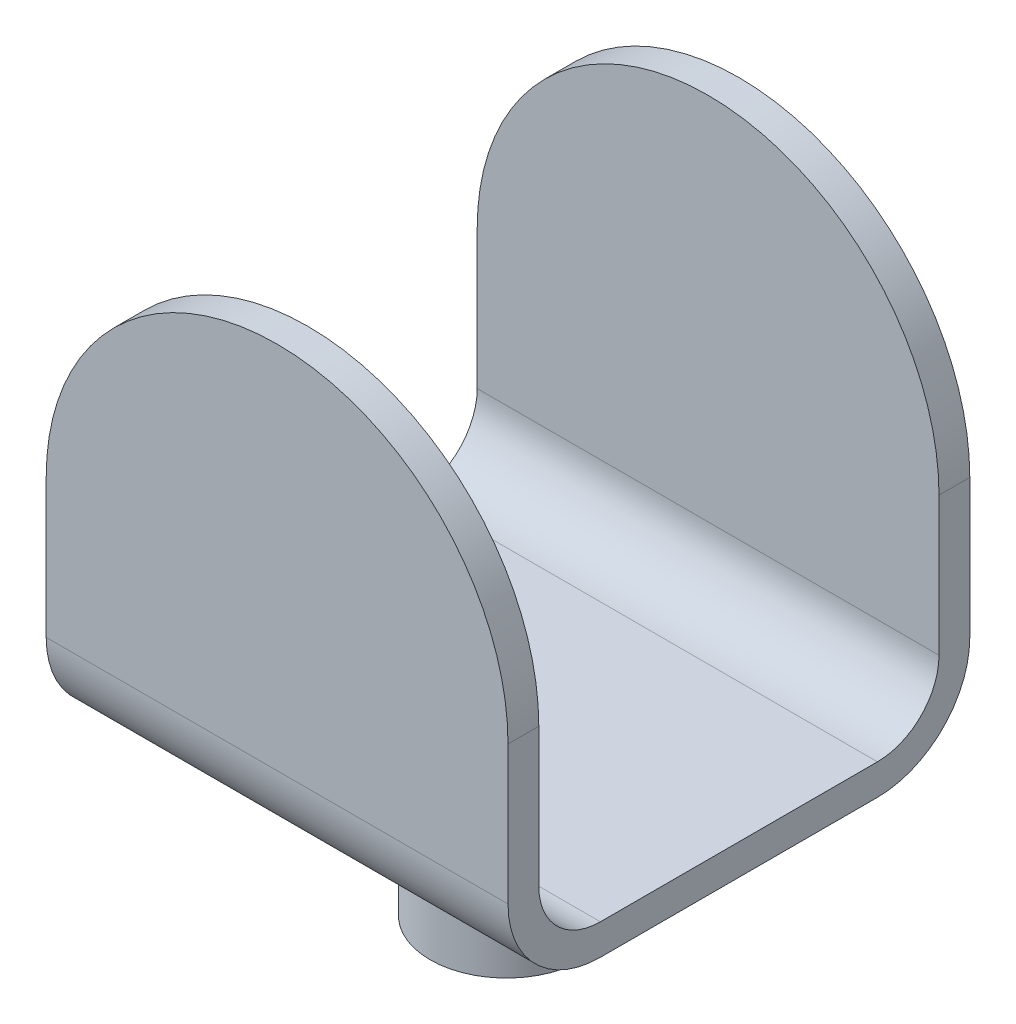
ISO-10303-21;
HEADER;
FILE_DESCRIPTION(('STEP AP214'),'2;1');
FILE_NAME('part.step','',(''),(''),'','','');
FILE_SCHEMA(('AUTOMOTIVE_DESIGN { 1 0 10303 214 1 1 1 1 }'));
ENDSEC;
DATA;
#1=APPLICATION_CONTEXT('core data for automotive mechanical design processes');
#2=APPLICATION_PROTOCOL_DEFINITION('international standard','automotive_design',2000,#1);
#3=PRODUCT_CONTEXT('',#1,'mechanical');
#4=PRODUCT('Part','Part','',(#3));
#5=PRODUCT_RELATED_PRODUCT_CATEGORY('part','',(#4));
#6=PRODUCT_DEFINITION_FORMATION('','',#4);
#7=PRODUCT_DEFINITION_CONTEXT('part definition',#1,'design');
#8=PRODUCT_DEFINITION('design','',#6,#7);
#9=PRODUCT_DEFINITION_SHAPE('','',#8);
#10=(LENGTH_UNIT() NAMED_UNIT(*) SI_UNIT(.MILLI.,.METRE.));
#11=(NAMED_UNIT(*) PLANE_ANGLE_UNIT() SI_UNIT($,.RADIAN.));
#12=(NAMED_UNIT(*) SI_UNIT($,.STERADIAN.) SOLID_ANGLE_UNIT());
#13=UNCERTAINTY_MEASURE_WITH_UNIT(LENGTH_MEASURE(1.E-05),#10,'distance_accuracy_value','');
#14=(GEOMETRIC_REPRESENTATION_CONTEXT(3) GLOBAL_UNCERTAINTY_ASSIGNED_CONTEXT((#13)) GLOBAL_UNIT_ASSIGNED_CONTEXT((#10,
#11,#12)) REPRESENTATION_CONTEXT('',''));
#15=CARTESIAN_POINT('',(0.,0.,0.));
#16=DIRECTION('',(0.,0.,1.));
#17=DIRECTION('',(1.,0.,0.));
#18=AXIS2_PLACEMENT_3D('',#15,#16,#17);
#19=CARTESIAN_POINT('',(38.1034902062651,38.1034902062652,76.2));
#20=DIRECTION('',(0.,0.,-1.));
#21=DIRECTION('',(-1.,0.,0.));
#22=AXIS2_PLACEMENT_3D('',#19,#20,#21);
#23=CYLINDRICAL_SURFACE('',#22,38.1034902062651);
#24=CARTESIAN_POINT('',(38.1034902062651,38.1034902062652,71.12));
#25=DIRECTION('',(0.,0.,1.));
#26=DIRECTION('',(1.,0.,0.));
#27=AXIS2_PLACEMENT_3D('',#24,#25,#26);
#28=CIRCLE('',#27,38.1034902062651);
#29=CARTESIAN_POINT('',(0.,38.1034902062652,71.12));
#30=VERTEX_POINT('',#29);
#31=CARTESIAN_POINT('',(76.2069804125302,38.1034902062652,71.12));
#32=VERTEX_POINT('',#31);
#33=EDGE_CURVE('E191',#30,#32,#28,.F.);
#34=ORIENTED_EDGE('',*,*,#33,.F.);
#35=DIRECTION('',(0.,0.,-1.));
#36=VECTOR('',#35,1.);
#37=CARTESIAN_POINT('',(0.,38.1034902062652,76.2));
#38=LINE('',#37,#36);
#39=CARTESIAN_POINT('',(0.,38.1034902062652,76.2));
#40=VERTEX_POINT('',#39);
#41=EDGE_CURVE('E247',#40,#30,#38,.T.);
#42=ORIENTED_EDGE('',*,*,#41,.F.);
#43=CARTESIAN_POINT('',(38.1034902062651,38.1034902062652,76.2));
#44=DIRECTION('',(0.,0.,-1.));
#45=DIRECTION('',(-1.,0.,0.));
#46=AXIS2_PLACEMENT_3D('',#43,#44,#45);
#47=CIRCLE('',#46,38.1034902062651);
#48=CARTESIAN_POINT('',(76.2069804125302,38.1034902062652,76.2));
#49=VERTEX_POINT('',#48);
#50=EDGE_CURVE('E255',#49,#40,#47,.F.);
#51=ORIENTED_EDGE('',*,*,#50,.F.);
#52=DIRECTION('',(0.,0.,1.));
#53=VECTOR('',#52,1.);
#54=CARTESIAN_POINT('',(76.2069804125302,38.1034902062652,76.2));
#55=LINE('',#54,#53);
#56=EDGE_CURVE('E251',#32,#49,#55,.T.);
#57=ORIENTED_EDGE('',*,*,#56,.F.);
#58=EDGE_LOOP('',(#34,#42,#51,#57));
#59=FACE_BOUND('',#58,.T.);
#60=ADVANCED_FACE('F45',(#59),#23,.T.);
#61=CARTESIAN_POINT('',(38.1034902062651,38.1034902062652,5.08));
#62=DIRECTION('',(0.,0.,-1.));
#63=DIRECTION('',(-1.,0.,0.));
#64=AXIS2_PLACEMENT_3D('',#61,#62,#63);
#65=CIRCLE('',#64,38.1034902062651);
#66=CARTESIAN_POINT('',(76.2069804125302,38.1034902062652,5.08));
#67=VERTEX_POINT('',#66);
#68=CARTESIAN_POINT('',(0.,38.1034902062652,5.08));
#69=VERTEX_POINT('',#68);
#70=EDGE_CURVE('E184',#67,#69,#65,.F.);
#71=ORIENTED_EDGE('',*,*,#70,.F.);
#72=CARTESIAN_POINT('',(76.2069804125302,38.1034902062652,0.));
#73=VERTEX_POINT('',#72);
#74=EDGE_CURVE('E252',#73,#67,#55,.T.);
#75=ORIENTED_EDGE('',*,*,#74,.F.);
#76=CARTESIAN_POINT('',(38.1034902062651,38.1034902062652,0.));
#77=DIRECTION('',(0.,0.,-1.));
#78=DIRECTION('',(-1.,0.,0.));
#79=AXIS2_PLACEMENT_3D('',#76,#77,#78);
#80=CIRCLE('',#79,38.1034902062651);
#81=CARTESIAN_POINT('',(0.,38.1034902062652,0.));
#82=VERTEX_POINT('',#81);
#83=EDGE_CURVE('E70',#82,#73,#80,.T.);
#84=ORIENTED_EDGE('',*,*,#83,.F.);
#85=EDGE_CURVE('E246',#69,#82,#38,.T.);
#86=ORIENTED_EDGE('',*,*,#85,.F.);
#87=EDGE_LOOP('',(#71,#75,#84,#86));
#88=FACE_BOUND('',#87,.T.);
#89=ADVANCED_FACE('F48',(#88),#23,.T.);
#90=CARTESIAN_POINT('',(0.,0.,76.2));
#91=DIRECTION('',(-1.,0.,0.));
#92=DIRECTION('',(0.,0.,1.));
#93=AXIS2_PLACEMENT_3D('',#90,#91,#92);
#94=PLANE('',#93);
#95=DIRECTION('',(0.,1.,0.));
#96=VECTOR('',#95,1.);
#97=CARTESIAN_POINT('',(0.,0.,71.12));
#98=LINE('',#97,#96);
#99=CARTESIAN_POINT('',(0.,15.24,71.12));
#100=VERTEX_POINT('',#99);
#101=EDGE_CURVE('E187',#100,#30,#98,.T.);
#102=ORIENTED_EDGE('',*,*,#101,.F.);
#103=CARTESIAN_POINT('',(0.,15.24,60.96));
#104=DIRECTION('',(-1.,0.,0.));
#105=DIRECTION('',(0.,0.,1.));
#106=AXIS2_PLACEMENT_3D('',#103,#104,#105);
#107=CIRCLE('',#106,10.16);
#108=CARTESIAN_POINT('',(0.,5.08,60.96));
#109=VERTEX_POINT('',#108);
#110=EDGE_CURVE('E194',#109,#100,#107,.T.);
#111=ORIENTED_EDGE('',*,*,#110,.F.);
#112=DIRECTION('',(0.,0.,1.));
#113=VECTOR('',#112,1.);
#114=CARTESIAN_POINT('',(0.,5.08,76.2));
#115=LINE('',#114,#113);
#116=CARTESIAN_POINT('',(0.,5.08,15.24));
#117=VERTEX_POINT('',#116);
#118=EDGE_CURVE('E172',#117,#109,#115,.T.);
#119=ORIENTED_EDGE('',*,*,#118,.F.);
#120=CARTESIAN_POINT('',(0.,15.24,15.24));
#121=DIRECTION('',(-1.,0.,0.));
#122=DIRECTION('',(0.,0.,1.));
#123=AXIS2_PLACEMENT_3D('',#120,#121,#122);
#124=CIRCLE('',#123,10.16);
#125=CARTESIAN_POINT('',(0.,15.24,5.08));
#126=VERTEX_POINT('',#125);
#127=EDGE_CURVE('E147',#126,#117,#124,.T.);
#128=ORIENTED_EDGE('',*,*,#127,.F.);
#129=DIRECTION('',(0.,-1.,0.));
#130=VECTOR('',#129,1.);
#131=CARTESIAN_POINT('',(0.,0.,5.08));
#132=LINE('',#131,#130);
#133=EDGE_CURVE('E181',#69,#126,#132,.T.);
#134=ORIENTED_EDGE('',*,*,#133,.F.);
#135=ORIENTED_EDGE('',*,*,#85,.T.);
#136=DIRECTION('',(0.,1.,0.));
#137=VECTOR('',#136,1.);
#138=CARTESIAN_POINT('',(0.,0.,0.));
#139=LINE('',#138,#137);
#140=CARTESIAN_POINT('',(0.,15.24,0.));
#141=VERTEX_POINT('',#140);
#142=EDGE_CURVE('E197',#141,#82,#139,.T.);
#143=ORIENTED_EDGE('',*,*,#142,.F.);
#144=CARTESIAN_POINT('',(0.,15.24,15.24));
#145=DIRECTION('',(-1.,0.,0.));
#146=DIRECTION('',(0.,0.,1.));
#147=AXIS2_PLACEMENT_3D('',#144,#145,#146);
#148=CIRCLE('',#147,15.24);
#149=CARTESIAN_POINT('',(0.,0.,15.24));
#150=VERTEX_POINT('',#149);
#151=EDGE_CURVE('E237',#141,#150,#148,.T.);
#152=ORIENTED_EDGE('',*,*,#151,.T.);
#153=DIRECTION('',(0.,0.,-1.));
#154=VECTOR('',#153,1.);
#155=CARTESIAN_POINT('',(0.,0.,76.2));
#156=LINE('',#155,#154);
#157=CARTESIAN_POINT('',(0.,0.,60.96));
#158=VERTEX_POINT('',#157);
#159=EDGE_CURVE('E213',#158,#150,#156,.T.);
#160=ORIENTED_EDGE('',*,*,#159,.F.);
#161=CARTESIAN_POINT('',(0.,15.24,60.96));
#162=DIRECTION('',(-1.,0.,0.));
#163=DIRECTION('',(0.,0.,1.));
#164=AXIS2_PLACEMENT_3D('',#161,#162,#163);
#165=CIRCLE('',#164,15.24);
#166=CARTESIAN_POINT('',(0.,15.24,76.2));
#167=VERTEX_POINT('',#166);
#168=EDGE_CURVE('E240',#158,#167,#165,.T.);
#169=ORIENTED_EDGE('',*,*,#168,.T.);
#170=DIRECTION('',(0.,1.,0.));
#171=VECTOR('',#170,1.);
#172=CARTESIAN_POINT('',(0.,0.,76.2));
#173=LINE('',#172,#171);
#174=EDGE_CURVE('E198',#167,#40,#173,.T.);
#175=ORIENTED_EDGE('',*,*,#174,.T.);
#176=ORIENTED_EDGE('',*,*,#41,.T.);
#177=EDGE_LOOP('',(#102,#111,#119,#128,#134,#135,#143,#152,#160,#169,#175,#176));
#178=FACE_BOUND('',#177,.T.);
#179=ADVANCED_FACE('F276',(#178),#94,.T.);
#180=CARTESIAN_POINT('',(0.,0.,76.2));
#181=DIRECTION('',(0.,1.,0.));
#182=DIRECTION('',(0.,0.,1.));
#183=AXIS2_PLACEMENT_3D('',#180,#181,#182);
#184=PLANE('',#183);
#185=CARTESIAN_POINT('',(37.1140400081818,0.,37.3517449776447));
#186=DIRECTION('',(0.,1.,0.));
#187=DIRECTION('',(0.,0.,1.));
#188=AXIS2_PLACEMENT_3D('',#185,#186,#187);
#189=CIRCLE('',#188,12.615490025562);
#190=CARTESIAN_POINT('',(37.1140400081818,0.,49.9672350032066));
#191=VERTEX_POINT('',#190);
#192=EDGE_CURVE('E11',#191,#191,#189,.F.);
#193=ORIENTED_EDGE('',*,*,#192,.F.);
#194=EDGE_LOOP('',(#193));
#195=FACE_BOUND('',#194,.T.);
#196=DIRECTION('',(0.,0.,-1.));
#197=VECTOR('',#196,1.);
#198=CARTESIAN_POINT('',(76.2069804125302,0.,76.2));
#199=LINE('',#198,#197);
#200=CARTESIAN_POINT('',(76.2069804125302,0.,60.96));
#201=VERTEX_POINT('',#200);
#202=CARTESIAN_POINT('',(76.2069804125302,0.,15.24));
#203=VERTEX_POINT('',#202);
#204=EDGE_CURVE('E207',#201,#203,#199,.T.);
#205=ORIENTED_EDGE('',*,*,#204,.F.);
#206=DIRECTION('',(1.,0.,0.));
#207=VECTOR('',#206,1.);
#208=CARTESIAN_POINT('',(0.,0.,60.96));
#209=LINE('',#208,#207);
#210=EDGE_CURVE('E234',#201,#158,#209,.F.);
#211=ORIENTED_EDGE('',*,*,#210,.T.);
#212=ORIENTED_EDGE('',*,*,#159,.T.);
#213=DIRECTION('',(1.,0.,0.));
#214=VECTOR('',#213,1.);
#215=CARTESIAN_POINT('',(76.2069804125302,0.,15.24));
#216=LINE('',#215,#214);
#217=EDGE_CURVE('E230',#150,#203,#216,.T.);
#218=ORIENTED_EDGE('',*,*,#217,.T.);
#219=EDGE_LOOP('',(#205,#211,#212,#218));
#220=FACE_BOUND('',#219,.T.);
#221=ADVANCED_FACE('F289',(#195,#220),#184,.F.);
#222=CARTESIAN_POINT('',(76.2069804125302,0.,76.2));
#223=DIRECTION('',(-1.,0.,0.));
#224=DIRECTION('',(0.,0.,1.));
#225=AXIS2_PLACEMENT_3D('',#222,#223,#224);
#226=PLANE('',#225);
#227=CARTESIAN_POINT('',(76.2069804125302,15.24,60.96));
#228=DIRECTION('',(1.,0.,0.));
#229=DIRECTION('',(0.,0.,-1.));
#230=AXIS2_PLACEMENT_3D('',#227,#228,#229);
#231=CIRCLE('',#230,10.16);
#232=CARTESIAN_POINT('',(76.2069804125302,15.24,71.12));
#233=VERTEX_POINT('',#232);
#234=CARTESIAN_POINT('',(76.2069804125302,5.08,60.96));
#235=VERTEX_POINT('',#234);
#236=EDGE_CURVE('E62',#233,#235,#231,.T.);
#237=ORIENTED_EDGE('',*,*,#236,.F.);
#238=DIRECTION('',(0.,1.,0.));
#239=VECTOR('',#238,1.);
#240=CARTESIAN_POINT('',(76.2069804125302,0.,71.12));
#241=LINE('',#240,#239);
#242=EDGE_CURVE('E55',#233,#32,#241,.T.);
#243=ORIENTED_EDGE('',*,*,#242,.T.);
#244=ORIENTED_EDGE('',*,*,#56,.T.);
#245=DIRECTION('',(0.,1.,0.));
#246=VECTOR('',#245,1.);
#247=CARTESIAN_POINT('',(76.2069804125302,0.,76.2));
#248=LINE('',#247,#246);
#249=CARTESIAN_POINT('',(76.2069804125302,15.24,76.2));
#250=VERTEX_POINT('',#249);
#251=EDGE_CURVE('E202',#250,#49,#248,.T.);
#252=ORIENTED_EDGE('',*,*,#251,.F.);
#253=CARTESIAN_POINT('',(76.2069804125302,15.24,60.96));
#254=DIRECTION('',(-1.,0.,0.));
#255=DIRECTION('',(0.,0.,1.));
#256=AXIS2_PLACEMENT_3D('',#253,#254,#255);
#257=CIRCLE('',#256,15.24);
#258=EDGE_CURVE('E227',#250,#201,#257,.F.);
#259=ORIENTED_EDGE('',*,*,#258,.T.);
#260=ORIENTED_EDGE('',*,*,#204,.T.);
#261=CARTESIAN_POINT('',(76.2069804125302,15.24,15.24));
#262=DIRECTION('',(-1.,0.,0.));
#263=DIRECTION('',(0.,0.,1.));
#264=AXIS2_PLACEMENT_3D('',#261,#262,#263);
#265=CIRCLE('',#264,15.24);
#266=CARTESIAN_POINT('',(76.2069804125302,15.24,0.));
#267=VERTEX_POINT('',#266);
#268=EDGE_CURVE('E224',#203,#267,#265,.F.);
#269=ORIENTED_EDGE('',*,*,#268,.T.);
#270=DIRECTION('',(0.,1.,0.));
#271=VECTOR('',#270,1.);
#272=CARTESIAN_POINT('',(76.2069804125302,0.,0.));
#273=LINE('',#272,#271);
#274=EDGE_CURVE('E203',#267,#73,#273,.T.);
#275=ORIENTED_EDGE('',*,*,#274,.T.);
#276=ORIENTED_EDGE('',*,*,#74,.T.);
#277=DIRECTION('',(0.,1.,0.));
#278=VECTOR('',#277,1.);
#279=CARTESIAN_POINT('',(76.2069804125302,38.1034902062652,5.08));
#280=LINE('',#279,#278);
#281=CARTESIAN_POINT('',(76.2069804125302,15.24,5.08));
#282=VERTEX_POINT('',#281);
#283=EDGE_CURVE('E162',#282,#67,#280,.T.);
#284=ORIENTED_EDGE('',*,*,#283,.F.);
#285=CARTESIAN_POINT('',(76.2069804125302,15.24,15.24));
#286=DIRECTION('',(1.,0.,0.));
#287=DIRECTION('',(0.,0.,-1.));
#288=AXIS2_PLACEMENT_3D('',#285,#286,#287);
#289=CIRCLE('',#288,10.16);
#290=CARTESIAN_POINT('',(76.2069804125302,5.08,15.24));
#291=VERTEX_POINT('',#290);
#292=EDGE_CURVE('E144',#291,#282,#289,.T.);
#293=ORIENTED_EDGE('',*,*,#292,.F.);
#294=DIRECTION('',(0.,0.,-1.));
#295=VECTOR('',#294,1.);
#296=CARTESIAN_POINT('',(76.2069804125302,5.08,60.96));
#297=LINE('',#296,#295);
#298=EDGE_CURVE('E155',#235,#291,#297,.T.);
#299=ORIENTED_EDGE('',*,*,#298,.F.);
#300=EDGE_LOOP('',(#237,#243,#244,#252,#259,#260,#269,#275,#276,#284,#293,#299));
#301=FACE_BOUND('',#300,.T.);
#302=ADVANCED_FACE('F160',(#301),#226,.F.);
#303=CARTESIAN_POINT('',(0.,0.,76.2));
#304=DIRECTION('',(0.,0.,-1.));
#305=DIRECTION('',(-1.,0.,0.));
#306=AXIS2_PLACEMENT_3D('',#303,#304,#305);
#307=PLANE('',#306);
#308=ORIENTED_EDGE('',*,*,#251,.T.);
#309=ORIENTED_EDGE('',*,*,#50,.T.);
#310=ORIENTED_EDGE('',*,*,#174,.F.);
#311=DIRECTION('',(1.,0.,0.));
#312=VECTOR('',#311,1.);
#313=CARTESIAN_POINT('',(0.,15.24,76.2));
#314=LINE('',#313,#312);
#315=EDGE_CURVE('E217',#167,#250,#314,.T.);
#316=ORIENTED_EDGE('',*,*,#315,.T.);
#317=EDGE_LOOP('',(#308,#309,#310,#316));
#318=FACE_BOUND('',#317,.T.);
#319=ADVANCED_FACE('F296',(#318),#307,.F.);
#320=CARTESIAN_POINT('',(0.,0.,0.));
#321=DIRECTION('',(0.,0.,-1.));
#322=DIRECTION('',(-1.,0.,0.));
#323=AXIS2_PLACEMENT_3D('',#320,#321,#322);
#324=PLANE('',#323);
#325=ORIENTED_EDGE('',*,*,#142,.T.);
#326=ORIENTED_EDGE('',*,*,#83,.T.);
#327=ORIENTED_EDGE('',*,*,#274,.F.);
#328=DIRECTION('',(1.,0.,0.));
#329=VECTOR('',#328,1.);
#330=CARTESIAN_POINT('',(0.,15.24,0.));
#331=LINE('',#330,#329);
#332=EDGE_CURVE('E243',#267,#141,#331,.F.);
#333=ORIENTED_EDGE('',*,*,#332,.T.);
#334=EDGE_LOOP('',(#325,#326,#327,#333));
#335=FACE_BOUND('',#334,.T.);
#336=ADVANCED_FACE('F280',(#335),#324,.T.);
#337=CARTESIAN_POINT('',(0.,15.24,60.96));
#338=DIRECTION('',(1.,0.,0.));
#339=DIRECTION('',(0.,0.,-1.));
#340=AXIS2_PLACEMENT_3D('',#337,#338,#339);
#341=CYLINDRICAL_SURFACE('',#340,15.24);
#342=ORIENTED_EDGE('',*,*,#168,.F.);
#343=ORIENTED_EDGE('',*,*,#210,.F.);
#344=ORIENTED_EDGE('',*,*,#258,.F.);
#345=ORIENTED_EDGE('',*,*,#315,.F.);
#346=EDGE_LOOP('',(#342,#343,#344,#345));
#347=FACE_BOUND('',#346,.T.);
#348=ADVANCED_FACE('F292',(#347),#341,.T.);
#349=CARTESIAN_POINT('',(0.,15.24,15.24));
#350=DIRECTION('',(-1.,0.,0.));
#351=DIRECTION('',(0.,0.,1.));
#352=AXIS2_PLACEMENT_3D('',#349,#350,#351);
#353=CYLINDRICAL_SURFACE('',#352,15.24);
#354=ORIENTED_EDGE('',*,*,#151,.F.);
#355=ORIENTED_EDGE('',*,*,#332,.F.);
#356=ORIENTED_EDGE('',*,*,#268,.F.);
#357=ORIENTED_EDGE('',*,*,#217,.F.);
#358=EDGE_LOOP('',(#354,#355,#356,#357));
#359=FACE_BOUND('',#358,.T.);
#360=ADVANCED_FACE('F283',(#359),#353,.T.);
#361=CARTESIAN_POINT('',(-131.31101958747,15.24,60.96));
#362=DIRECTION('',(1.,0.,0.));
#363=DIRECTION('',(0.,0.,-1.));
#364=AXIS2_PLACEMENT_3D('',#361,#362,#363);
#365=CYLINDRICAL_SURFACE('',#364,10.16);
#366=ORIENTED_EDGE('',*,*,#110,.T.);
#367=DIRECTION('',(1.,0.,0.));
#368=VECTOR('',#367,1.);
#369=CARTESIAN_POINT('',(-131.31101958747,15.24,71.12));
#370=LINE('',#369,#368);
#371=EDGE_CURVE('E169',#100,#233,#370,.T.);
#372=ORIENTED_EDGE('',*,*,#371,.T.);
#373=ORIENTED_EDGE('',*,*,#236,.T.);
#374=DIRECTION('',(1.,0.,0.));
#375=VECTOR('',#374,1.);
#376=CARTESIAN_POINT('',(-131.31101958747,5.08,60.96));
#377=LINE('',#376,#375);
#378=EDGE_CURVE('E152',#109,#235,#377,.T.);
#379=ORIENTED_EDGE('',*,*,#378,.F.);
#380=EDGE_LOOP('',(#366,#372,#373,#379));
#381=FACE_BOUND('',#380,.T.);
#382=ADVANCED_FACE('F299',(#381),#365,.F.);
#383=CARTESIAN_POINT('',(-131.31101958747,38.1034902062652,71.12));
#384=DIRECTION('',(0.,0.,1.));
#385=DIRECTION('',(1.,0.,0.));
#386=AXIS2_PLACEMENT_3D('',#383,#384,#385);
#387=PLANE('',#386);
#388=ORIENTED_EDGE('',*,*,#33,.T.);
#389=ORIENTED_EDGE('',*,*,#242,.F.);
#390=ORIENTED_EDGE('',*,*,#371,.F.);
#391=ORIENTED_EDGE('',*,*,#101,.T.);
#392=EDGE_LOOP('',(#388,#389,#390,#391));
#393=FACE_BOUND('',#392,.T.);
#394=ADVANCED_FACE('F298',(#393),#387,.F.);
#395=CARTESIAN_POINT('',(-131.31101958747,38.1034902062652,5.08));
#396=DIRECTION('',(0.,0.,-1.));
#397=DIRECTION('',(-1.,0.,0.));
#398=AXIS2_PLACEMENT_3D('',#395,#396,#397);
#399=PLANE('',#398);
#400=ORIENTED_EDGE('',*,*,#70,.T.);
#401=ORIENTED_EDGE('',*,*,#133,.T.);
#402=DIRECTION('',(1.,0.,0.));
#403=VECTOR('',#402,1.);
#404=CARTESIAN_POINT('',(-131.31101958747,15.24,5.08));
#405=LINE('',#404,#403);
#406=EDGE_CURVE('E151',#126,#282,#405,.T.);
#407=ORIENTED_EDGE('',*,*,#406,.T.);
#408=ORIENTED_EDGE('',*,*,#283,.T.);
#409=EDGE_LOOP('',(#400,#401,#407,#408));
#410=FACE_BOUND('',#409,.T.);
#411=ADVANCED_FACE('F306',(#410),#399,.F.);
#412=CARTESIAN_POINT('',(-131.31101958747,15.24,15.24));
#413=DIRECTION('',(1.,0.,0.));
#414=DIRECTION('',(0.,0.,-1.));
#415=AXIS2_PLACEMENT_3D('',#412,#413,#414);
#416=CYLINDRICAL_SURFACE('',#415,10.16);
#417=ORIENTED_EDGE('',*,*,#127,.T.);
#418=DIRECTION('',(1.,0.,0.));
#419=VECTOR('',#418,1.);
#420=CARTESIAN_POINT('',(-131.31101958747,5.08,15.24));
#421=LINE('',#420,#419);
#422=EDGE_CURVE('E139',#117,#291,#421,.T.);
#423=ORIENTED_EDGE('',*,*,#422,.T.);
#424=ORIENTED_EDGE('',*,*,#292,.T.);
#425=ORIENTED_EDGE('',*,*,#406,.F.);
#426=EDGE_LOOP('',(#417,#423,#424,#425));
#427=FACE_BOUND('',#426,.T.);
#428=ADVANCED_FACE('F141',(#427),#416,.F.);
#429=CARTESIAN_POINT('',(-131.31101958747,5.08,60.96));
#430=DIRECTION('',(0.,-1.,0.));
#431=DIRECTION('',(0.,0.,-1.));
#432=AXIS2_PLACEMENT_3D('',#429,#430,#431);
#433=PLANE('',#432);
#434=ORIENTED_EDGE('',*,*,#118,.T.);
#435=ORIENTED_EDGE('',*,*,#378,.T.);
#436=ORIENTED_EDGE('',*,*,#298,.T.);
#437=ORIENTED_EDGE('',*,*,#422,.F.);
#438=EDGE_LOOP('',(#434,#435,#436,#437));
#439=FACE_BOUND('',#438,.T.);
#440=ADVANCED_FACE('F156',(#439),#433,.F.);
#441=CARTESIAN_POINT('',(37.1140400081818,-25.3999999999999,37.3517449776447));
#442=DIRECTION('',(0.,1.,0.));
#443=DIRECTION('',(0.,0.,1.));
#444=AXIS2_PLACEMENT_3D('',#441,#442,#443);
#445=CYLINDRICAL_SURFACE('',#444,12.615490025562);
#446=CARTESIAN_POINT('',(37.1140400081818,-25.3999999999999,37.3517449776447));
#447=DIRECTION('',(0.,-1.,0.));
#448=DIRECTION('',(0.,0.,-1.));
#449=AXIS2_PLACEMENT_3D('',#446,#447,#448);
#450=CIRCLE('',#449,12.615490025562);
#451=CARTESIAN_POINT('',(37.1140400081818,-25.3999999999999,24.7362549520827));
#452=VERTEX_POINT('',#451);
#453=EDGE_CURVE('E468',#452,#452,#450,.T.);
#454=ORIENTED_EDGE('',*,*,#453,.F.);
#455=EDGE_LOOP('',(#454));
#456=FACE_BOUND('',#455,.T.);
#457=ORIENTED_EDGE('',*,*,#192,.T.);
#458=EDGE_LOOP('',(#457));
#459=FACE_BOUND('',#458,.T.);
#460=ADVANCED_FACE('F354',(#456,#459),#445,.T.);
#461=CARTESIAN_POINT('',(37.1140400081818,-25.3999999999999,37.3517449776447));
#462=DIRECTION('',(0.,-1.,0.));
#463=DIRECTION('',(0.,0.,-1.));
#464=AXIS2_PLACEMENT_3D('',#461,#462,#463);
#465=PLANE('',#464);
#466=ORIENTED_EDGE('',*,*,#453,.T.);
#467=EDGE_LOOP('',(#466));
#468=FACE_BOUND('',#467,.T.);
#469=ADVANCED_FACE('F359',(#468),#465,.T.);
#470=CLOSED_SHELL('',(#60,#89,#179,#221,#302,#319,#336,#348,#360,#382,#394,#411,#428,#440,#460,#469));
#471=MANIFOLD_SOLID_BREP('B2',#470);
#472=ADVANCED_BREP_SHAPE_REPRESENTATION('',(#18,#471),#14);
#473=SHAPE_DEFINITION_REPRESENTATION(#9,#472);
ENDSEC;
END-ISO-10303-21;
